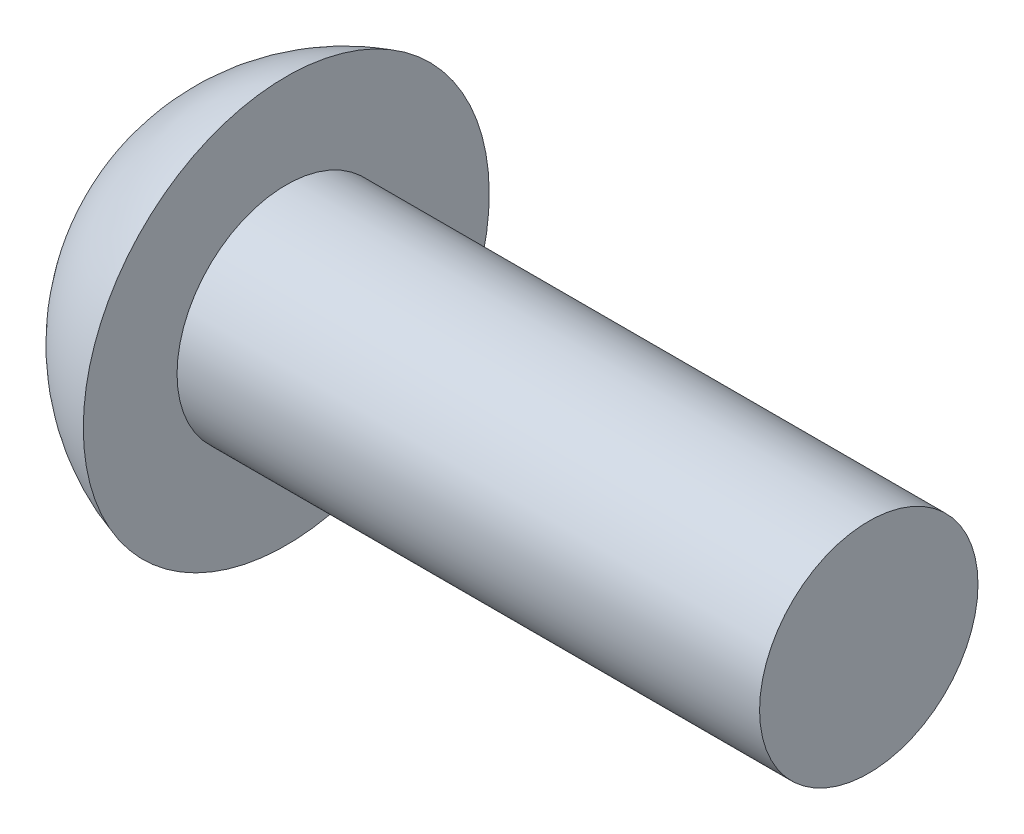
ISO-10303-21;
HEADER;
FILE_DESCRIPTION(('STEP AP214'),'2;1');
FILE_NAME('part.step','',(''),(''),'','','');
FILE_SCHEMA(('AUTOMOTIVE_DESIGN { 1 0 10303 214 1 1 1 1 }'));
ENDSEC;
DATA;
#1=APPLICATION_CONTEXT('core data for automotive mechanical design processes');
#2=APPLICATION_PROTOCOL_DEFINITION('international standard','automotive_design',2000,#1);
#3=PRODUCT_CONTEXT('',#1,'mechanical');
#4=PRODUCT('Part','Part','',(#3));
#5=PRODUCT_RELATED_PRODUCT_CATEGORY('part','',(#4));
#6=PRODUCT_DEFINITION_FORMATION('','',#4);
#7=PRODUCT_DEFINITION_CONTEXT('part definition',#1,'design');
#8=PRODUCT_DEFINITION('design','',#6,#7);
#9=PRODUCT_DEFINITION_SHAPE('','',#8);
#10=(LENGTH_UNIT() NAMED_UNIT(*) SI_UNIT(.MILLI.,.METRE.));
#11=(NAMED_UNIT(*) PLANE_ANGLE_UNIT() SI_UNIT($,.RADIAN.));
#12=(NAMED_UNIT(*) SI_UNIT($,.STERADIAN.) SOLID_ANGLE_UNIT());
#13=UNCERTAINTY_MEASURE_WITH_UNIT(LENGTH_MEASURE(1.E-05),#10,'distance_accuracy_value','');
#14=(GEOMETRIC_REPRESENTATION_CONTEXT(3) GLOBAL_UNCERTAINTY_ASSIGNED_CONTEXT((#13)) GLOBAL_UNIT_ASSIGNED_CONTEXT((#10,
#11,#12)) REPRESENTATION_CONTEXT('',''));
#15=CARTESIAN_POINT('',(0.,0.,0.));
#16=DIRECTION('',(0.,0.,1.));
#17=DIRECTION('',(1.,0.,0.));
#18=AXIS2_PLACEMENT_3D('',#15,#16,#17);
#19=CARTESIAN_POINT('',(2.9,0.,0.));
#20=DIRECTION('',(-1.,0.,0.));
#21=DIRECTION('',(0.,1.,0.));
#22=AXIS2_PLACEMENT_3D('',#19,#20,#21);
#23=SPHERICAL_SURFACE('',#22,2.9);
#24=CARTESIAN_POINT('',(2.1,0.,0.));
#25=DIRECTION('',(-1.,0.,0.));
#26=DIRECTION('',(0.,0.,1.));
#27=AXIS2_PLACEMENT_3D('',#24,#25,#26);
#28=CIRCLE('',#27,2.78747197295327);
#29=CARTESIAN_POINT('',(2.1,0.,2.78747197295327));
#30=VERTEX_POINT('',#29);
#31=EDGE_CURVE('E195',#30,#30,#28,.T.);
#32=ORIENTED_EDGE('',*,*,#31,.T.);
#33=EDGE_LOOP('',(#32));
#34=FACE_BOUND('',#33,.T.);
#35=CARTESIAN_POINT('',(0.078315280848916,0.,0.));
#36=DIRECTION('',(1.,0.,0.));
#37=DIRECTION('',(0.,0.,-1.));
#38=AXIS2_PLACEMENT_3D('',#35,#36,#37);
#39=CIRCLE('',#38,0.669399242387731);
#40=CARTESIAN_POINT('',(0.0783152808489151,-0.264999999999997,-0.61471159555459));
#41=VERTEX_POINT('',#40);
#42=CARTESIAN_POINT('',(0.078315280848916,-0.614711595554591,-0.265));
#43=VERTEX_POINT('',#42);
#44=EDGE_CURVE('E317',#41,#43,#39,.F.);
#45=ORIENTED_EDGE('',*,*,#44,.F.);
#46=CARTESIAN_POINT('',(2.9,-0.265,0.));
#47=DIRECTION('',(0.,1.,0.));
#48=DIRECTION('',(0.,0.,1.));
#49=AXIS2_PLACEMENT_3D('',#46,#47,#48);
#50=CIRCLE('',#49,2.88786685981193);
#51=CARTESIAN_POINT('',(0.337520560404616,-0.264999999999995,-1.33171848438434));
#52=VERTEX_POINT('',#51);
#53=EDGE_CURVE('E244',#52,#41,#50,.T.);
#54=ORIENTED_EDGE('',*,*,#53,.F.);
#55=CARTESIAN_POINT('',(2.92160851048534,0.,-0.0433399743390653));
#56=DIRECTION('',(0.446197753347436,0.,-0.894934391398443));
#57=DIRECTION('',(-0.894934391398443,0.,-0.446197753347436));
#58=AXIS2_PLACEMENT_3D('',#55,#56,#57);
#59=CIRCLE('',#58,2.89959561299484);
#60=CARTESIAN_POINT('',(0.337520560404616,0.265000000000005,-1.33171848438434));
#61=VERTEX_POINT('',#60);
#62=EDGE_CURVE('E218',#52,#61,#59,.T.);
#63=ORIENTED_EDGE('',*,*,#62,.T.);
#64=CARTESIAN_POINT('',(2.9,0.265,0.));
#65=DIRECTION('',(0.,-1.,0.));
#66=DIRECTION('',(0.,0.,-1.));
#67=AXIS2_PLACEMENT_3D('',#64,#65,#66);
#68=CIRCLE('',#67,2.88786685981193);
#69=CARTESIAN_POINT('',(0.0783152808489159,0.265000000000002,-0.614711595554588));
#70=VERTEX_POINT('',#69);
#71=EDGE_CURVE('E273',#70,#61,#68,.T.);
#72=ORIENTED_EDGE('',*,*,#71,.F.);
#73=CARTESIAN_POINT('',(0.078315280848916,0.614711595554587,-0.265));
#74=VERTEX_POINT('',#73);
#75=EDGE_CURVE('E333',#74,#70,#39,.F.);
#76=ORIENTED_EDGE('',*,*,#75,.F.);
#77=CARTESIAN_POINT('',(2.9,0.,-0.265));
#78=DIRECTION('',(0.,0.,1.));
#79=DIRECTION('',(0.,-1.,0.));
#80=AXIS2_PLACEMENT_3D('',#77,#78,#79);
#81=CIRCLE('',#80,2.88786685981193);
#82=CARTESIAN_POINT('',(0.337520560404617,1.33171848438434,-0.265));
#83=VERTEX_POINT('',#82);
#84=EDGE_CURVE('E212',#83,#74,#81,.T.);
#85=ORIENTED_EDGE('',*,*,#84,.F.);
#86=CARTESIAN_POINT('',(2.92160851048534,0.0433399743390649,0.));
#87=DIRECTION('',(0.446197753347436,0.894934391398443,0.));
#88=DIRECTION('',(-0.894934391398443,0.446197753347436,0.));
#89=AXIS2_PLACEMENT_3D('',#86,#87,#88);
#90=CIRCLE('',#89,2.89959561299484);
#91=CARTESIAN_POINT('',(0.337520560404617,1.33171848438434,0.265));
#92=VERTEX_POINT('',#91);
#93=EDGE_CURVE('E215',#83,#92,#90,.T.);
#94=ORIENTED_EDGE('',*,*,#93,.T.);
#95=CARTESIAN_POINT('',(2.9,0.,0.265));
#96=DIRECTION('',(0.,0.,-1.));
#97=DIRECTION('',(-1.,0.,0.));
#98=AXIS2_PLACEMENT_3D('',#95,#96,#97);
#99=CIRCLE('',#98,2.88786685981193);
#100=CARTESIAN_POINT('',(0.078315280848916,0.614711595554587,0.265));
#101=VERTEX_POINT('',#100);
#102=EDGE_CURVE('E203',#101,#92,#99,.T.);
#103=ORIENTED_EDGE('',*,*,#102,.F.);
#104=CARTESIAN_POINT('',(0.0783152808489156,0.264999999999998,0.614711595554589));
#105=VERTEX_POINT('',#104);
#106=EDGE_CURVE('E332',#105,#101,#39,.F.);
#107=ORIENTED_EDGE('',*,*,#106,.F.);
#108=CARTESIAN_POINT('',(0.337520560404616,0.264999999999995,1.33171848438434));
#109=VERTEX_POINT('',#108);
#110=EDGE_CURVE('E228',#109,#105,#68,.T.);
#111=ORIENTED_EDGE('',*,*,#110,.F.);
#112=CARTESIAN_POINT('',(2.92160851048534,0.,0.0433399743390653));
#113=DIRECTION('',(0.446197753347436,0.,0.894934391398443));
#114=DIRECTION('',(0.894934391398443,0.,-0.446197753347436));
#115=AXIS2_PLACEMENT_3D('',#112,#113,#114);
#116=CIRCLE('',#115,2.89959561299484);
#117=CARTESIAN_POINT('',(0.337520560404616,-0.265000000000004,1.33171848438434));
#118=VERTEX_POINT('',#117);
#119=EDGE_CURVE('E47',#109,#118,#116,.T.);
#120=ORIENTED_EDGE('',*,*,#119,.T.);
#121=CARTESIAN_POINT('',(0.0783152808489155,-0.265000000000002,0.614711595554588));
#122=VERTEX_POINT('',#121);
#123=EDGE_CURVE('E225',#122,#118,#50,.T.);
#124=ORIENTED_EDGE('',*,*,#123,.F.);
#125=CARTESIAN_POINT('',(0.078315280848916,-0.614711595554591,0.265));
#126=VERTEX_POINT('',#125);
#127=EDGE_CURVE('E363',#126,#122,#39,.F.);
#128=ORIENTED_EDGE('',*,*,#127,.F.);
#129=CARTESIAN_POINT('',(0.337520560404615,-1.33171848438434,0.264999999999999));
#130=VERTEX_POINT('',#129);
#131=EDGE_CURVE('E209',#130,#126,#99,.T.);
#132=ORIENTED_EDGE('',*,*,#131,.F.);
#133=CARTESIAN_POINT('',(2.92160851048534,-0.0433399743390657,0.));
#134=DIRECTION('',(0.446197753347436,-0.894934391398443,0.));
#135=DIRECTION('',(0.894934391398443,0.446197753347436,0.));
#136=AXIS2_PLACEMENT_3D('',#133,#134,#135);
#137=CIRCLE('',#136,2.89959561299484);
#138=CARTESIAN_POINT('',(0.337520560404615,-1.33171848438434,-0.265));
#139=VERTEX_POINT('',#138);
#140=EDGE_CURVE('E200',#130,#139,#137,.T.);
#141=ORIENTED_EDGE('',*,*,#140,.T.);
#142=EDGE_CURVE('E62',#43,#139,#81,.T.);
#143=ORIENTED_EDGE('',*,*,#142,.F.);
#144=EDGE_LOOP('',(#45,#54,#63,#72,#76,#85,#94,#103,#107,#111,#120,#124,#128,#132,#141,#143));
#145=FACE_BOUND('',#144,.T.);
#146=ADVANCED_FACE('F34',(#34,#145),#23,.T.);
#147=CARTESIAN_POINT('',(1.7,0.652411408052676,-0.265));
#148=DIRECTION('',(0.,0.,1.));
#149=DIRECTION('',(0.,-1.,0.));
#150=AXIS2_PLACEMENT_3D('',#147,#148,#149);
#151=PLANE('',#150);
#152=ORIENTED_EDGE('',*,*,#84,.T.);
#153=CARTESIAN_POINT('',(-0.981933015225682,0.694712374001879,-0.265));
#154=CARTESIAN_POINT('',(-0.777540178554923,0.67941354952456,-0.265));
#155=CARTESIAN_POINT('',(-0.573151839935429,0.664054243787275,-0.265));
#156=CARTESIAN_POINT('',(-0.164385971025144,0.633177915366396,-0.265));
#157=CARTESIAN_POINT('',(0.039991559201344,0.617660891831827,-0.265));
#158=CARTESIAN_POINT('',(0.448731756270768,0.586432540525166,-0.265));
#159=CARTESIAN_POINT('',(0.653094423116314,0.570721212787268,-0.265));
#160=CARTESIAN_POINT('',(1.06179964417998,0.539049879940202,-0.265));
#161=CARTESIAN_POINT('',(1.26614219847917,0.52308987587849,-0.265));
#162=CARTESIAN_POINT('',(1.74108068166978,0.485616257392884,-0.265));
#163=CARTESIAN_POINT('',(2.01166699100833,0.463980474763996,-0.265));
#164=CARTESIAN_POINT('',(2.55276895388886,0.419865793528032,-0.265));
#165=CARTESIAN_POINT('',(2.82328460806535,0.397386902774242,-0.265));
#166=CARTESIAN_POINT('',(3.22897582593126,0.362622847384073,-0.265));
#167=CARTESIAN_POINT('',(3.36419602364132,0.350860224074462,-0.265));
#168=CARTESIAN_POINT('',(3.63459299738675,0.326855757063686,-0.265));
#169=CARTESIAN_POINT('',(3.76976977370504,0.314613916551499,-0.265));
#170=CARTESIAN_POINT('',(4.04006905664263,0.289478504725017,-0.265));
#171=CARTESIAN_POINT('',(4.17519156089061,0.276584907518763,-0.265));
#172=CARTESIAN_POINT('',(4.44533503936018,0.249748787596908,-0.265));
#173=CARTESIAN_POINT('',(4.58035601113307,0.235806240354233,-0.265));
#174=CARTESIAN_POINT('',(4.71530211337658,0.221140684442859,-0.265));
#175=B_SPLINE_CURVE_WITH_KNOTS('',3,(#153,#154,#155,#156,#157,#158,#159,#160,#161,#162,#163,
#164,#165,#166,#167,#168,#169,#170,#171,#172,#173,#174),.UNSPECIFIED.,.F.,.F.,(4,2,2,2,2,2,2,2,
2,2,4),(0.,0.614893822921503,1.22979096530522,1.84468799948177,2.45958244433443,
3.27393151276002,4.08827299766283,4.49546484032848,4.90265397377325,5.30985929611757,
5.7170741429014),.UNSPECIFIED.);
#176=CARTESIAN_POINT('',(1.7,0.488785228909386,-0.265));
#177=VERTEX_POINT('',#176);
#178=EDGE_CURVE('E352',#74,#177,#175,.T.);
#179=ORIENTED_EDGE('',*,*,#178,.T.);
#180=DIRECTION('',(0.,1.,0.));
#181=VECTOR('',#180,1.);
#182=CARTESIAN_POINT('',(1.7,-0.652411408052676,-0.265));
#183=LINE('',#182,#181);
#184=CARTESIAN_POINT('',(1.7,0.652411408052676,-0.265));
#185=VERTEX_POINT('',#184);
#186=EDGE_CURVE('E296',#177,#185,#183,.T.);
#187=ORIENTED_EDGE('',*,*,#186,.T.);
#188=DIRECTION('',(0.894934391398443,-0.446197753347436,0.));
#189=VECTOR('',#188,1.);
#190=CARTESIAN_POINT('',(0.,1.5,-0.265));
#191=LINE('',#190,#189);
#192=EDGE_CURVE('E274',#83,#185,#191,.T.);
#193=ORIENTED_EDGE('',*,*,#192,.F.);
#194=EDGE_LOOP('',(#152,#179,#187,#193));
#195=FACE_BOUND('',#194,.T.);
#196=ADVANCED_FACE('F168',(#195),#151,.T.);
#197=CARTESIAN_POINT('',(1.7,-0.652411408052676,-0.265));
#198=VERTEX_POINT('',#197);
#199=CARTESIAN_POINT('',(1.7,-0.488785228909386,-0.265));
#200=VERTEX_POINT('',#199);
#201=EDGE_CURVE('E294',#198,#200,#183,.T.);
#202=ORIENTED_EDGE('',*,*,#201,.T.);
#203=CARTESIAN_POINT('',(-0.981933015225682,-0.694712374001879,-0.265));
#204=CARTESIAN_POINT('',(-0.777540178554923,-0.67941354952456,-0.265));
#205=CARTESIAN_POINT('',(-0.57315183993543,-0.664054243787275,-0.265));
#206=CARTESIAN_POINT('',(-0.164385971025144,-0.633177915366396,-0.265));
#207=CARTESIAN_POINT('',(0.0399915592013435,-0.617660891831827,-0.265));
#208=CARTESIAN_POINT('',(0.448731756270768,-0.586432540525166,-0.265));
#209=CARTESIAN_POINT('',(0.653094423116314,-0.570721212787268,-0.265));
#210=CARTESIAN_POINT('',(1.06179964417998,-0.539049879940202,-0.265));
#211=CARTESIAN_POINT('',(1.26614219847917,-0.52308987587849,-0.265));
#212=CARTESIAN_POINT('',(1.74108068166978,-0.485616257392883,-0.265));
#213=CARTESIAN_POINT('',(2.01166699100833,-0.463980474763996,-0.265));
#214=CARTESIAN_POINT('',(2.55276895388886,-0.419865793528032,-0.265));
#215=CARTESIAN_POINT('',(2.82328460806535,-0.397386902774242,-0.265));
#216=CARTESIAN_POINT('',(3.22897582593126,-0.362622847384073,-0.265));
#217=CARTESIAN_POINT('',(3.36419602364132,-0.350860224074462,-0.265));
#218=CARTESIAN_POINT('',(3.63459299738675,-0.326855757063686,-0.265));
#219=CARTESIAN_POINT('',(3.76976977370504,-0.314613916551499,-0.265));
#220=CARTESIAN_POINT('',(4.04006905664263,-0.289478504725017,-0.265));
#221=CARTESIAN_POINT('',(4.17519156089061,-0.276584907518762,-0.265));
#222=CARTESIAN_POINT('',(4.44533503936018,-0.249748787596907,-0.265));
#223=CARTESIAN_POINT('',(4.58035601113307,-0.235806240354233,-0.265));
#224=CARTESIAN_POINT('',(4.71530211337659,-0.221140684442858,-0.265));
#225=B_SPLINE_CURVE_WITH_KNOTS('',3,(#203,#204,#205,#206,#207,#208,#209,#210,#211,#212,#213,
#214,#215,#216,#217,#218,#219,#220,#221,#222,#223,#224),.UNSPECIFIED.,.F.,.F.,(4,2,2,2,2,2,2,2,
2,2,4),(0.,0.614893822921502,1.22979096530522,1.84468799948177,2.45958244433443,
3.27393151276002,4.08827299766283,4.49546484032848,4.90265397377325,5.30985929611757,
5.7170741429014),.UNSPECIFIED.);
#226=EDGE_CURVE('E331',#200,#43,#225,.F.);
#227=ORIENTED_EDGE('',*,*,#226,.T.);
#228=ORIENTED_EDGE('',*,*,#142,.T.);
#229=DIRECTION('',(0.894934391398443,0.446197753347436,0.));
#230=VECTOR('',#229,1.);
#231=CARTESIAN_POINT('',(0.,-1.5,-0.265));
#232=LINE('',#231,#230);
#233=EDGE_CURVE('E279',#139,#198,#232,.T.);
#234=ORIENTED_EDGE('',*,*,#233,.T.);
#235=EDGE_LOOP('',(#202,#227,#228,#234));
#236=FACE_BOUND('',#235,.T.);
#237=ADVANCED_FACE('F174',(#236),#151,.T.);
#238=CARTESIAN_POINT('',(1.7,-0.652411408052676,0.265));
#239=DIRECTION('',(0.,0.,-1.));
#240=DIRECTION('',(-1.,0.,0.));
#241=AXIS2_PLACEMENT_3D('',#238,#239,#240);
#242=PLANE('',#241);
#243=DIRECTION('',(0.,-1.,0.));
#244=VECTOR('',#243,1.);
#245=CARTESIAN_POINT('',(1.7,0.652411408052676,0.265));
#246=LINE('',#245,#244);
#247=CARTESIAN_POINT('',(1.7,0.652411408052676,0.265));
#248=VERTEX_POINT('',#247);
#249=CARTESIAN_POINT('',(1.7,0.488785228909386,0.264999999999999));
#250=VERTEX_POINT('',#249);
#251=EDGE_CURVE('E287',#248,#250,#246,.T.);
#252=ORIENTED_EDGE('',*,*,#251,.T.);
#253=CARTESIAN_POINT('',(-0.981933015224673,0.694712374001804,0.265));
#254=CARTESIAN_POINT('',(-0.777540178553934,0.679413549524486,0.265));
#255=CARTESIAN_POINT('',(-0.57315183993446,0.664054243787202,0.265));
#256=CARTESIAN_POINT('',(-0.164385971024213,0.633177915366326,0.265));
#257=CARTESIAN_POINT('',(0.0399915592022549,0.617660891831758,0.265));
#258=CARTESIAN_POINT('',(0.44873175627164,0.586432540525099,0.265));
#259=CARTESIAN_POINT('',(0.653094423117166,0.570721212787203,0.265));
#260=CARTESIAN_POINT('',(1.06179964418079,0.539049879940139,0.265));
#261=CARTESIAN_POINT('',(1.26614219847997,0.523089875878427,0.265));
#262=CARTESIAN_POINT('',(1.74108068167055,0.485616257392822,0.265));
#263=CARTESIAN_POINT('',(2.01166699100911,0.463980474763934,0.265));
#264=CARTESIAN_POINT('',(2.55276895388964,0.419865793527968,0.265));
#265=CARTESIAN_POINT('',(2.82328460806612,0.397386902774177,0.265));
#266=CARTESIAN_POINT('',(3.22897582593204,0.362622847384006,0.265));
#267=CARTESIAN_POINT('',(3.36419602364209,0.350860224074395,0.265));
#268=CARTESIAN_POINT('',(3.63459299738752,0.326855757063616,0.265));
#269=CARTESIAN_POINT('',(3.76976977370581,0.314613916551428,0.265));
#270=CARTESIAN_POINT('',(4.0400690566434,0.289478504724944,0.265));
#271=CARTESIAN_POINT('',(4.17519156089139,0.276584907518687,0.265));
#272=CARTESIAN_POINT('',(4.44533503936095,0.249748787596828,0.265));
#273=CARTESIAN_POINT('',(4.58035601113385,0.235806240354151,0.265));
#274=CARTESIAN_POINT('',(4.71530211337736,0.221140684442774,0.265));
#275=B_SPLINE_CURVE_WITH_KNOTS('',3,(#253,#254,#255,#256,#257,#258,#259,#260,#261,#262,#263,
#264,#265,#266,#267,#268,#269,#270,#271,#272,#273,#274),.UNSPECIFIED.,.F.,.F.,(4,2,2,2,2,2,2,2,
2,2,4),(0.,0.614893822921444,1.2297909653051,1.8446879994816,2.4595824443342,3.27393151275979,
4.0882729976626,4.49546484032825,4.90265397377302,5.30985929611733,5.71707414290117),.UNSPECIFIED.);
#276=EDGE_CURVE('E249',#250,#101,#275,.F.);
#277=ORIENTED_EDGE('',*,*,#276,.T.);
#278=ORIENTED_EDGE('',*,*,#102,.T.);
#279=DIRECTION('',(0.894934391398443,-0.446197753347436,0.));
#280=VECTOR('',#279,1.);
#281=CARTESIAN_POINT('',(0.,1.5,0.265));
#282=LINE('',#281,#280);
#283=EDGE_CURVE('E277',#92,#248,#282,.T.);
#284=ORIENTED_EDGE('',*,*,#283,.T.);
#285=EDGE_LOOP('',(#252,#277,#278,#284));
#286=FACE_BOUND('',#285,.T.);
#287=ADVANCED_FACE('F348',(#286),#242,.T.);
#288=ORIENTED_EDGE('',*,*,#131,.T.);
#289=CARTESIAN_POINT('',(-0.981933015225681,-0.694712374001879,0.264999999999999));
#290=CARTESIAN_POINT('',(-0.777540178554922,-0.67941354952456,0.264999999999999));
#291=CARTESIAN_POINT('',(-0.573151839935429,-0.664054243787275,0.264999999999999));
#292=CARTESIAN_POINT('',(-0.164385971025144,-0.633177915366396,0.265));
#293=CARTESIAN_POINT('',(0.039991559201344,-0.617660891831827,0.265));
#294=CARTESIAN_POINT('',(0.448731756270768,-0.586432540525166,0.265));
#295=CARTESIAN_POINT('',(0.653094423116314,-0.570721212787269,0.265));
#296=CARTESIAN_POINT('',(1.06179964417998,-0.539049879940202,0.265));
#297=CARTESIAN_POINT('',(1.26614219847917,-0.52308987587849,0.265));
#298=CARTESIAN_POINT('',(1.74108068166978,-0.485616257392884,0.265));
#299=CARTESIAN_POINT('',(2.01166699100833,-0.463980474763996,0.265));
#300=CARTESIAN_POINT('',(2.55276895388886,-0.419865793528032,0.265));
#301=CARTESIAN_POINT('',(2.82328460806535,-0.397386902774242,0.265));
#302=CARTESIAN_POINT('',(3.22897582593126,-0.362622847384073,0.265));
#303=CARTESIAN_POINT('',(3.36419602364132,-0.350860224074462,0.265));
#304=CARTESIAN_POINT('',(3.63459299738675,-0.326855757063686,0.265));
#305=CARTESIAN_POINT('',(3.76976977370504,-0.314613916551499,0.265));
#306=CARTESIAN_POINT('',(4.04006905664263,-0.289478504725017,0.265));
#307=CARTESIAN_POINT('',(4.17519156089061,-0.276584907518762,0.265));
#308=CARTESIAN_POINT('',(4.44533503936018,-0.249748787596907,0.265));
#309=CARTESIAN_POINT('',(4.58035601113307,-0.235806240354233,0.265));
#310=CARTESIAN_POINT('',(4.71530211337659,-0.221140684442858,0.265));
#311=B_SPLINE_CURVE_WITH_KNOTS('',3,(#289,#290,#291,#292,#293,#294,#295,#296,#297,#298,#299,
#300,#301,#302,#303,#304,#305,#306,#307,#308,#309,#310),.UNSPECIFIED.,.F.,.F.,(4,2,2,2,2,2,2,2,
2,2,4),(0.,0.614893822921502,1.22979096530522,1.84468799948177,2.45958244433443,
3.27393151276002,4.08827299766283,4.49546484032848,4.90265397377325,5.30985929611757,
5.7170741429014),.UNSPECIFIED.);
#312=CARTESIAN_POINT('',(1.7,-0.488785228909386,0.264999999999999));
#313=VERTEX_POINT('',#312);
#314=EDGE_CURVE('E364',#126,#313,#311,.T.);
#315=ORIENTED_EDGE('',*,*,#314,.T.);
#316=CARTESIAN_POINT('',(1.7,-0.652411408052676,0.265));
#317=VERTEX_POINT('',#316);
#318=EDGE_CURVE('E290',#313,#317,#246,.T.);
#319=ORIENTED_EDGE('',*,*,#318,.T.);
#320=DIRECTION('',(0.894934391398443,0.446197753347436,0.));
#321=VECTOR('',#320,1.);
#322=CARTESIAN_POINT('',(0.,-1.5,0.264999999999999));
#323=LINE('',#322,#321);
#324=EDGE_CURVE('E281',#130,#317,#323,.T.);
#325=ORIENTED_EDGE('',*,*,#324,.F.);
#326=EDGE_LOOP('',(#288,#315,#319,#325));
#327=FACE_BOUND('',#326,.T.);
#328=ADVANCED_FACE('F394',(#327),#242,.T.);
#329=CARTESIAN_POINT('',(1.7,0.652411408052676,-0.265));
#330=DIRECTION('',(-1.,0.,0.));
#331=DIRECTION('',(0.,0.,1.));
#332=AXIS2_PLACEMENT_3D('',#329,#330,#331);
#333=PLANE('',#332);
#334=ORIENTED_EDGE('',*,*,#318,.F.);
#335=CARTESIAN_POINT('',(1.7,0.,0.));
#336=DIRECTION('',(-1.,0.,0.));
#337=DIRECTION('',(0.,0.,1.));
#338=AXIS2_PLACEMENT_3D('',#335,#336,#337);
#339=CIRCLE('',#338,0.556);
#340=EDGE_CURVE('E326',#200,#313,#339,.T.);
#341=ORIENTED_EDGE('',*,*,#340,.F.);
#342=ORIENTED_EDGE('',*,*,#201,.F.);
#343=DIRECTION('',(0.,0.,1.));
#344=VECTOR('',#343,1.);
#345=CARTESIAN_POINT('',(1.7,-0.652411408052676,-0.265));
#346=LINE('',#345,#344);
#347=EDGE_CURVE('E284',#198,#317,#346,.T.);
#348=ORIENTED_EDGE('',*,*,#347,.T.);
#349=EDGE_LOOP('',(#334,#341,#342,#348));
#350=FACE_BOUND('',#349,.T.);
#351=ADVANCED_FACE('F387',(#350),#333,.T.);
#352=DIRECTION('',(0.,0.,-1.));
#353=VECTOR('',#352,1.);
#354=CARTESIAN_POINT('',(1.7,-0.265000000000002,0.652411408052675));
#355=LINE('',#354,#353);
#356=CARTESIAN_POINT('',(1.7,-0.264999999999998,-0.488785228909387));
#357=VERTEX_POINT('',#356);
#358=CARTESIAN_POINT('',(1.7,-0.264999999999997,-0.652411408052677));
#359=VERTEX_POINT('',#358);
#360=EDGE_CURVE('E266',#357,#359,#355,.T.);
#361=ORIENTED_EDGE('',*,*,#360,.F.);
#362=CARTESIAN_POINT('',(1.7,0.265000000000002,-0.488785228909384));
#363=VERTEX_POINT('',#362);
#364=EDGE_CURVE('E54',#363,#357,#339,.T.);
#365=ORIENTED_EDGE('',*,*,#364,.F.);
#366=DIRECTION('',(0.,0.,1.));
#367=VECTOR('',#366,1.);
#368=CARTESIAN_POINT('',(1.7,0.265000000000002,-0.652411408052675));
#369=LINE('',#368,#367);
#370=CARTESIAN_POINT('',(1.7,0.265000000000002,-0.652411408052675));
#371=VERTEX_POINT('',#370);
#372=EDGE_CURVE('E269',#371,#363,#369,.T.);
#373=ORIENTED_EDGE('',*,*,#372,.F.);
#374=DIRECTION('',(0.,-1.,0.));
#375=VECTOR('',#374,1.);
#376=CARTESIAN_POINT('',(1.7,0.265000000000002,-0.652411408052675));
#377=LINE('',#376,#375);
#378=EDGE_CURVE('E260',#371,#359,#377,.T.);
#379=ORIENTED_EDGE('',*,*,#378,.T.);
#380=EDGE_LOOP('',(#361,#365,#373,#379));
#381=FACE_BOUND('',#380,.T.);
#382=ADVANCED_FACE('F321',(#381),#333,.T.);
#383=ORIENTED_EDGE('',*,*,#186,.F.);
#384=EDGE_CURVE('E325',#250,#177,#339,.T.);
#385=ORIENTED_EDGE('',*,*,#384,.F.);
#386=ORIENTED_EDGE('',*,*,#251,.F.);
#387=DIRECTION('',(0.,0.,-1.));
#388=VECTOR('',#387,1.);
#389=CARTESIAN_POINT('',(1.7,0.652411408052676,0.265));
#390=LINE('',#389,#388);
#391=EDGE_CURVE('E291',#248,#185,#390,.T.);
#392=ORIENTED_EDGE('',*,*,#391,.T.);
#393=EDGE_LOOP('',(#383,#385,#386,#392));
#394=FACE_BOUND('',#393,.T.);
#395=ADVANCED_FACE('F388',(#394),#333,.T.);
#396=CARTESIAN_POINT('',(1.7,0.264999999999998,0.652411408052677));
#397=DIRECTION('',(0.,-1.,0.));
#398=DIRECTION('',(0.,0.,-1.));
#399=AXIS2_PLACEMENT_3D('',#396,#397,#398);
#400=PLANE('',#399);
#401=ORIENTED_EDGE('',*,*,#110,.T.);
#402=CARTESIAN_POINT('',(-0.981933015225681,0.264999999999998,0.69471237400188));
#403=CARTESIAN_POINT('',(-0.777540178554922,0.264999999999998,0.679413549524561));
#404=CARTESIAN_POINT('',(-0.573151839935429,0.264999999999998,0.664054243787276));
#405=CARTESIAN_POINT('',(-0.164385971025144,0.264999999999998,0.633177915366397));
#406=CARTESIAN_POINT('',(0.039991559201344,0.264999999999998,0.617660891831827));
#407=CARTESIAN_POINT('',(0.448731756270768,0.264999999999998,0.586432540525167));
#408=CARTESIAN_POINT('',(0.653094423116314,0.264999999999998,0.570721212787269));
#409=CARTESIAN_POINT('',(1.06179964417998,0.264999999999998,0.539049879940203));
#410=CARTESIAN_POINT('',(1.26614219847917,0.264999999999998,0.523089875878491));
#411=CARTESIAN_POINT('',(1.74108068166978,0.264999999999998,0.485616257392884));
#412=CARTESIAN_POINT('',(2.01166699100833,0.264999999999998,0.463980474763997));
#413=CARTESIAN_POINT('',(2.55276895388886,0.264999999999998,0.419865793528033));
#414=CARTESIAN_POINT('',(2.82328460806535,0.264999999999999,0.397386902774243));
#415=CARTESIAN_POINT('',(3.22897582593126,0.264999999999999,0.362622847384074));
#416=CARTESIAN_POINT('',(3.36419602364132,0.264999999999999,0.350860224074463));
#417=CARTESIAN_POINT('',(3.63459299738675,0.264999999999999,0.326855757063687));
#418=CARTESIAN_POINT('',(3.76976977370504,0.264999999999999,0.3146139165515));
#419=CARTESIAN_POINT('',(4.04006905664263,0.264999999999999,0.289478504725018));
#420=CARTESIAN_POINT('',(4.17519156089061,0.264999999999999,0.276584907518763));
#421=CARTESIAN_POINT('',(4.44533503936018,0.264999999999999,0.249748787596908));
#422=CARTESIAN_POINT('',(4.58035601113307,0.264999999999999,0.235806240354234));
#423=CARTESIAN_POINT('',(4.71530211337659,0.264999999999999,0.221140684442859));
#424=B_SPLINE_CURVE_WITH_KNOTS('',3,(#402,#403,#404,#405,#406,#407,#408,#409,#410,#411,#412,
#413,#414,#415,#416,#417,#418,#419,#420,#421,#422,#423),.UNSPECIFIED.,.F.,.F.,(4,2,2,2,2,2,2,2,
2,2,4),(0.,0.614893822921502,1.22979096530522,1.84468799948177,2.45958244433443,
3.27393151276002,4.08827299766283,4.49546484032848,4.90265397377325,5.30985929611757,
5.7170741429014),.UNSPECIFIED.);
#425=CARTESIAN_POINT('',(1.7,0.264999999999998,0.488785228909386));
#426=VERTEX_POINT('',#425);
#427=EDGE_CURVE('E413',#105,#426,#424,.T.);
#428=ORIENTED_EDGE('',*,*,#427,.T.);
#429=CARTESIAN_POINT('',(1.7,0.264999999999998,0.652411408052677));
#430=VERTEX_POINT('',#429);
#431=EDGE_CURVE('E242',#426,#430,#369,.T.);
#432=ORIENTED_EDGE('',*,*,#431,.T.);
#433=DIRECTION('',(0.894934391398443,0.,-0.446197753347436));
#434=VECTOR('',#433,1.);
#435=CARTESIAN_POINT('',(0.,0.264999999999995,1.5));
#436=LINE('',#435,#434);
#437=EDGE_CURVE('E235',#109,#430,#436,.T.);
#438=ORIENTED_EDGE('',*,*,#437,.F.);
#439=EDGE_LOOP('',(#401,#428,#432,#438));
#440=FACE_BOUND('',#439,.T.);
#441=ADVANCED_FACE('F239',(#440),#400,.T.);
#442=CARTESIAN_POINT('',(1.7,-0.264999999999997,-0.652411408052677));
#443=DIRECTION('',(0.,1.,0.));
#444=DIRECTION('',(-1.,0.,0.));
#445=AXIS2_PLACEMENT_3D('',#442,#443,#444);
#446=PLANE('',#445);
#447=CARTESIAN_POINT('',(1.7,-0.265000000000002,0.652411408052675));
#448=VERTEX_POINT('',#447);
#449=CARTESIAN_POINT('',(1.7,-0.265000000000002,0.488785228909384));
#450=VERTEX_POINT('',#449);
#451=EDGE_CURVE('E263',#448,#450,#355,.T.);
#452=ORIENTED_EDGE('',*,*,#451,.T.);
#453=CARTESIAN_POINT('',(-0.981933015224674,-0.265000000000002,0.694712374001803));
#454=CARTESIAN_POINT('',(-0.777540178553935,-0.265000000000002,0.679413549524485));
#455=CARTESIAN_POINT('',(-0.573151839934461,-0.265000000000002,0.664054243787201));
#456=CARTESIAN_POINT('',(-0.164385971024214,-0.265000000000002,0.633177915366325));
#457=CARTESIAN_POINT('',(0.0399915592022547,-0.265000000000002,0.617660891831756));
#458=CARTESIAN_POINT('',(0.44873175627164,-0.265000000000002,0.586432540525098));
#459=CARTESIAN_POINT('',(0.653094423117166,-0.265000000000002,0.570721212787202));
#460=CARTESIAN_POINT('',(1.06179964418079,-0.265000000000002,0.539049879940138));
#461=CARTESIAN_POINT('',(1.26614219847997,-0.265000000000002,0.523089875878427));
#462=CARTESIAN_POINT('',(1.74108068167055,-0.265000000000002,0.485616257392821));
#463=CARTESIAN_POINT('',(2.01166699100911,-0.265000000000002,0.463980474763933));
#464=CARTESIAN_POINT('',(2.55276895388964,-0.265000000000001,0.419865793527967));
#465=CARTESIAN_POINT('',(2.82328460806612,-0.265000000000001,0.397386902774176));
#466=CARTESIAN_POINT('',(3.22897582593204,-0.265000000000001,0.362622847384005));
#467=CARTESIAN_POINT('',(3.36419602364209,-0.265000000000001,0.350860224074393));
#468=CARTESIAN_POINT('',(3.63459299738752,-0.265000000000001,0.326855757063615));
#469=CARTESIAN_POINT('',(3.76976977370582,-0.265000000000001,0.314613916551427));
#470=CARTESIAN_POINT('',(4.0400690566434,-0.265000000000001,0.289478504724943));
#471=CARTESIAN_POINT('',(4.17519156089139,-0.265000000000001,0.276584907518686));
#472=CARTESIAN_POINT('',(4.44533503936095,-0.265000000000001,0.249748787596827));
#473=CARTESIAN_POINT('',(4.58035601113385,-0.265000000000001,0.235806240354151));
#474=CARTESIAN_POINT('',(4.71530211337736,-0.265000000000001,0.221140684442773));
#475=B_SPLINE_CURVE_WITH_KNOTS('',3,(#453,#454,#455,#456,#457,#458,#459,#460,#461,#462,#463,
#464,#465,#466,#467,#468,#469,#470,#471,#472,#473,#474),.UNSPECIFIED.,.F.,.F.,(4,2,2,2,2,2,2,2,
2,2,4),(0.,0.614893822921444,1.2297909653051,1.8446879994816,2.4595824443342,3.27393151275979,
4.0882729976626,4.49546484032825,4.90265397377302,5.30985929611733,5.71707414290117),.UNSPECIFIED.);
#476=EDGE_CURVE('E357',#450,#122,#475,.F.);
#477=ORIENTED_EDGE('',*,*,#476,.T.);
#478=ORIENTED_EDGE('',*,*,#123,.T.);
#479=DIRECTION('',(0.894934391398443,0.,-0.446197753347436));
#480=VECTOR('',#479,1.);
#481=CARTESIAN_POINT('',(0.,-0.265000000000005,1.5));
#482=LINE('',#481,#480);
#483=EDGE_CURVE('E237',#118,#448,#482,.T.);
#484=ORIENTED_EDGE('',*,*,#483,.T.);
#485=EDGE_LOOP('',(#452,#477,#478,#484));
#486=FACE_BOUND('',#485,.T.);
#487=ADVANCED_FACE('F368',(#486),#446,.T.);
#488=ORIENTED_EDGE('',*,*,#372,.T.);
#489=CARTESIAN_POINT('',(-0.981933015224674,0.265000000000003,-0.694712374001803));
#490=CARTESIAN_POINT('',(-0.777540178553934,0.265000000000002,-0.679413549524485));
#491=CARTESIAN_POINT('',(-0.57315183993446,0.265000000000002,-0.664054243787201));
#492=CARTESIAN_POINT('',(-0.164385971024214,0.265000000000002,-0.633177915366325));
#493=CARTESIAN_POINT('',(0.0399915592022546,0.265000000000002,-0.617660891831756));
#494=CARTESIAN_POINT('',(0.44873175627164,0.265000000000002,-0.586432540525098));
#495=CARTESIAN_POINT('',(0.653094423117166,0.265000000000002,-0.570721212787202));
#496=CARTESIAN_POINT('',(1.06179964418079,0.265000000000002,-0.539049879940138));
#497=CARTESIAN_POINT('',(1.26614219847997,0.265000000000002,-0.523089875878426));
#498=CARTESIAN_POINT('',(1.74108068167055,0.265000000000002,-0.485616257392821));
#499=CARTESIAN_POINT('',(2.01166699100911,0.265000000000002,-0.463980474763933));
#500=CARTESIAN_POINT('',(2.55276895388964,0.265000000000001,-0.419865793527967));
#501=CARTESIAN_POINT('',(2.82328460806612,0.265000000000001,-0.397386902774176));
#502=CARTESIAN_POINT('',(3.22897582593204,0.265000000000001,-0.362622847384005));
#503=CARTESIAN_POINT('',(3.36419602364209,0.265000000000001,-0.350860224074394));
#504=CARTESIAN_POINT('',(3.63459299738752,0.265000000000001,-0.326855757063616));
#505=CARTESIAN_POINT('',(3.76976977370582,0.265000000000001,-0.314613916551427));
#506=CARTESIAN_POINT('',(4.0400690566434,0.265000000000001,-0.289478504724943));
#507=CARTESIAN_POINT('',(4.17519156089139,0.265000000000001,-0.276584907518687));
#508=CARTESIAN_POINT('',(4.44533503936095,0.265000000000001,-0.249748787596828));
#509=CARTESIAN_POINT('',(4.58035601113384,0.265000000000001,-0.235806240354151));
#510=CARTESIAN_POINT('',(4.71530211337736,0.265000000000001,-0.221140684442773));
#511=B_SPLINE_CURVE_WITH_KNOTS('',3,(#489,#490,#491,#492,#493,#494,#495,#496,#497,#498,#499,
#500,#501,#502,#503,#504,#505,#506,#507,#508,#509,#510),.UNSPECIFIED.,.F.,.F.,(4,2,2,2,2,2,2,2,
2,2,4),(0.,0.614893822921444,1.2297909653051,1.8446879994816,2.4595824443342,3.27393151275979,
4.0882729976626,4.49546484032825,4.90265397377302,5.30985929611733,5.71707414290117),.UNSPECIFIED.);
#512=EDGE_CURVE('E309',#363,#70,#511,.F.);
#513=ORIENTED_EDGE('',*,*,#512,.T.);
#514=ORIENTED_EDGE('',*,*,#71,.T.);
#515=DIRECTION('',(0.894934391398443,0.,0.446197753347436));
#516=VECTOR('',#515,1.);
#517=CARTESIAN_POINT('',(0.,0.265000000000005,-1.5));
#518=LINE('',#517,#516);
#519=EDGE_CURVE('E246',#61,#371,#518,.T.);
#520=ORIENTED_EDGE('',*,*,#519,.T.);
#521=EDGE_LOOP('',(#488,#513,#514,#520));
#522=FACE_BOUND('',#521,.T.);
#523=ADVANCED_FACE('F307',(#522),#400,.T.);
#524=ORIENTED_EDGE('',*,*,#53,.T.);
#525=CARTESIAN_POINT('',(-0.981933015225682,-0.264999999999997,-0.69471237400188));
#526=CARTESIAN_POINT('',(-0.777540178554923,-0.264999999999997,-0.679413549524561));
#527=CARTESIAN_POINT('',(-0.57315183993543,-0.264999999999997,-0.664054243787276));
#528=CARTESIAN_POINT('',(-0.164385971025144,-0.264999999999997,-0.633177915366398));
#529=CARTESIAN_POINT('',(0.0399915592013435,-0.264999999999997,-0.617660891831828));
#530=CARTESIAN_POINT('',(0.448731756270768,-0.264999999999998,-0.586432540525167));
#531=CARTESIAN_POINT('',(0.653094423116314,-0.264999999999998,-0.570721212787269));
#532=CARTESIAN_POINT('',(1.06179964417998,-0.264999999999998,-0.539049879940203));
#533=CARTESIAN_POINT('',(1.26614219847917,-0.264999999999998,-0.523089875878491));
#534=CARTESIAN_POINT('',(1.74108068166978,-0.264999999999998,-0.485616257392884));
#535=CARTESIAN_POINT('',(2.01166699100833,-0.264999999999998,-0.463980474763997));
#536=CARTESIAN_POINT('',(2.55276895388886,-0.264999999999998,-0.419865793528033));
#537=CARTESIAN_POINT('',(2.82328460806535,-0.264999999999999,-0.397386902774243));
#538=CARTESIAN_POINT('',(3.22897582593126,-0.264999999999999,-0.362622847384074));
#539=CARTESIAN_POINT('',(3.36419602364132,-0.264999999999999,-0.350860224074463));
#540=CARTESIAN_POINT('',(3.63459299738675,-0.264999999999999,-0.326855757063687));
#541=CARTESIAN_POINT('',(3.76976977370504,-0.264999999999999,-0.3146139165515));
#542=CARTESIAN_POINT('',(4.04006905664263,-0.264999999999999,-0.289478504725018));
#543=CARTESIAN_POINT('',(4.17519156089061,-0.264999999999999,-0.276584907518763));
#544=CARTESIAN_POINT('',(4.44533503936018,-0.264999999999999,-0.249748787596908));
#545=CARTESIAN_POINT('',(4.58035601113307,-0.264999999999999,-0.235806240354234));
#546=CARTESIAN_POINT('',(4.71530211337658,-0.264999999999999,-0.221140684442859));
#547=B_SPLINE_CURVE_WITH_KNOTS('',3,(#525,#526,#527,#528,#529,#530,#531,#532,#533,#534,#535,
#536,#537,#538,#539,#540,#541,#542,#543,#544,#545,#546),.UNSPECIFIED.,.F.,.F.,(4,2,2,2,2,2,2,2,
2,2,4),(0.,0.614893822921502,1.22979096530522,1.84468799948177,2.45958244433443,
3.27393151276002,4.08827299766283,4.49546484032848,4.90265397377325,5.30985929611757,
5.7170741429014),.UNSPECIFIED.);
#548=EDGE_CURVE('E11',#41,#357,#547,.T.);
#549=ORIENTED_EDGE('',*,*,#548,.T.);
#550=ORIENTED_EDGE('',*,*,#360,.T.);
#551=DIRECTION('',(0.894934391398443,0.,0.446197753347436));
#552=VECTOR('',#551,1.);
#553=CARTESIAN_POINT('',(0.,-0.264999999999994,-1.5));
#554=LINE('',#553,#552);
#555=EDGE_CURVE('E257',#52,#359,#554,.T.);
#556=ORIENTED_EDGE('',*,*,#555,.F.);
#557=EDGE_LOOP('',(#524,#549,#550,#556));
#558=FACE_BOUND('',#557,.T.);
#559=ADVANCED_FACE('F191',(#558),#446,.T.);
#560=CARTESIAN_POINT('',(-25.4,0.,0.));
#561=DIRECTION('',(-1.,0.,0.));
#562=DIRECTION('',(0.,0.,1.));
#563=AXIS2_PLACEMENT_3D('',#560,#561,#562);
#564=CYLINDRICAL_SURFACE('',#563,1.5);
#565=CARTESIAN_POINT('',(10.1,0.,0.));
#566=DIRECTION('',(-1.,0.,0.));
#567=DIRECTION('',(0.,0.,1.));
#568=AXIS2_PLACEMENT_3D('',#565,#566,#567);
#569=CIRCLE('',#568,1.5);
#570=CARTESIAN_POINT('',(10.1,0.,1.5));
#571=VERTEX_POINT('',#570);
#572=EDGE_CURVE('E205',#571,#571,#569,.T.);
#573=ORIENTED_EDGE('',*,*,#572,.T.);
#574=EDGE_LOOP('',(#573));
#575=FACE_BOUND('',#574,.T.);
#576=CARTESIAN_POINT('',(2.1,0.,0.));
#577=DIRECTION('',(-1.,0.,0.));
#578=DIRECTION('',(0.,0.,1.));
#579=AXIS2_PLACEMENT_3D('',#576,#577,#578);
#580=CIRCLE('',#579,1.5);
#581=CARTESIAN_POINT('',(2.1,0.,1.5));
#582=VERTEX_POINT('',#581);
#583=EDGE_CURVE('E198',#582,#582,#580,.T.);
#584=ORIENTED_EDGE('',*,*,#583,.F.);
#585=EDGE_LOOP('',(#584));
#586=FACE_BOUND('',#585,.T.);
#587=ADVANCED_FACE('F36',(#575,#586),#564,.T.);
#588=CARTESIAN_POINT('',(2.1,1.5,0.));
#589=DIRECTION('',(-1.,0.,0.));
#590=DIRECTION('',(0.,0.,1.));
#591=AXIS2_PLACEMENT_3D('',#588,#589,#590);
#592=PLANE('',#591);
#593=ORIENTED_EDGE('',*,*,#31,.F.);
#594=EDGE_LOOP('',(#593));
#595=FACE_BOUND('',#594,.T.);
#596=ORIENTED_EDGE('',*,*,#583,.T.);
#597=EDGE_LOOP('',(#596));
#598=FACE_BOUND('',#597,.T.);
#599=ADVANCED_FACE('F182',(#595,#598),#592,.F.);
#600=CARTESIAN_POINT('',(10.1,1.5,0.));
#601=DIRECTION('',(1.,0.,0.));
#602=DIRECTION('',(0.,0.,-1.));
#603=AXIS2_PLACEMENT_3D('',#600,#601,#602);
#604=PLANE('',#603);
#605=ORIENTED_EDGE('',*,*,#572,.F.);
#606=EDGE_LOOP('',(#605));
#607=FACE_BOUND('',#606,.T.);
#608=ADVANCED_FACE('F180',(#607),#604,.T.);
#609=CARTESIAN_POINT('',(1.7,0.652411408052676,0.265));
#610=DIRECTION('',(0.446197753347436,0.894934391398443,0.));
#611=DIRECTION('',(-0.894934391398443,0.446197753347436,0.));
#612=AXIS2_PLACEMENT_3D('',#609,#610,#611);
#613=PLANE('',#612);
#614=ORIENTED_EDGE('',*,*,#192,.T.);
#615=ORIENTED_EDGE('',*,*,#391,.F.);
#616=ORIENTED_EDGE('',*,*,#283,.F.);
#617=ORIENTED_EDGE('',*,*,#93,.F.);
#618=EDGE_LOOP('',(#614,#615,#616,#617));
#619=FACE_BOUND('',#618,.T.);
#620=ADVANCED_FACE('F189',(#619),#613,.F.);
#621=CARTESIAN_POINT('',(1.7,-0.652411408052676,-0.265));
#622=DIRECTION('',(0.446197753347436,-0.894934391398443,0.));
#623=DIRECTION('',(0.894934391398443,0.446197753347436,0.));
#624=AXIS2_PLACEMENT_3D('',#621,#622,#623);
#625=PLANE('',#624);
#626=ORIENTED_EDGE('',*,*,#324,.T.);
#627=ORIENTED_EDGE('',*,*,#347,.F.);
#628=ORIENTED_EDGE('',*,*,#233,.F.);
#629=ORIENTED_EDGE('',*,*,#140,.F.);
#630=EDGE_LOOP('',(#626,#627,#628,#629));
#631=FACE_BOUND('',#630,.T.);
#632=ADVANCED_FACE('F385',(#631),#625,.F.);
#633=ORIENTED_EDGE('',*,*,#431,.F.);
#634=EDGE_CURVE('E329',#450,#426,#339,.T.);
#635=ORIENTED_EDGE('',*,*,#634,.F.);
#636=ORIENTED_EDGE('',*,*,#451,.F.);
#637=DIRECTION('',(0.,1.,0.));
#638=VECTOR('',#637,1.);
#639=CARTESIAN_POINT('',(1.7,-0.265000000000002,0.652411408052675));
#640=LINE('',#639,#638);
#641=EDGE_CURVE('E267',#448,#430,#640,.T.);
#642=ORIENTED_EDGE('',*,*,#641,.T.);
#643=EDGE_LOOP('',(#633,#635,#636,#642));
#644=FACE_BOUND('',#643,.T.);
#645=ADVANCED_FACE('F381',(#644),#333,.T.);
#646=CARTESIAN_POINT('',(1.7,-0.265000000000002,0.652411408052675));
#647=DIRECTION('',(0.446197753347436,0.,0.894934391398443));
#648=DIRECTION('',(-0.894934391398443,0.,0.446197753347436));
#649=AXIS2_PLACEMENT_3D('',#646,#647,#648);
#650=PLANE('',#649);
#651=ORIENTED_EDGE('',*,*,#437,.T.);
#652=ORIENTED_EDGE('',*,*,#641,.F.);
#653=ORIENTED_EDGE('',*,*,#483,.F.);
#654=ORIENTED_EDGE('',*,*,#119,.F.);
#655=EDGE_LOOP('',(#651,#652,#653,#654));
#656=FACE_BOUND('',#655,.T.);
#657=ADVANCED_FACE('F233',(#656),#650,.F.);
#658=CARTESIAN_POINT('',(1.7,0.265000000000002,-0.652411408052675));
#659=DIRECTION('',(0.446197753347436,0.,-0.894934391398443));
#660=DIRECTION('',(0.894934391398443,0.,0.446197753347436));
#661=AXIS2_PLACEMENT_3D('',#658,#659,#660);
#662=PLANE('',#661);
#663=ORIENTED_EDGE('',*,*,#555,.T.);
#664=ORIENTED_EDGE('',*,*,#378,.F.);
#665=ORIENTED_EDGE('',*,*,#519,.F.);
#666=ORIENTED_EDGE('',*,*,#62,.F.);
#667=EDGE_LOOP('',(#663,#664,#665,#666));
#668=FACE_BOUND('',#667,.T.);
#669=ADVANCED_FACE('F312',(#668),#662,.F.);
#670=CARTESIAN_POINT('',(1.7,0.,0.));
#671=DIRECTION('',(-1.,0.,0.));
#672=DIRECTION('',(0.,0.,1.));
#673=AXIS2_PLACEMENT_3D('',#670,#671,#672);
#674=CONICAL_SURFACE('',#673,0.556,0.0698131700797659);
#675=EDGE_CURVE('E327',#426,#250,#339,.T.);
#676=ORIENTED_EDGE('',*,*,#675,.F.);
#677=ORIENTED_EDGE('',*,*,#427,.F.);
#678=ORIENTED_EDGE('',*,*,#106,.T.);
#679=ORIENTED_EDGE('',*,*,#276,.F.);
#680=EDGE_LOOP('',(#676,#677,#678,#679));
#681=FACE_BOUND('',#680,.T.);
#682=ADVANCED_FACE('F165',(#681),#674,.F.);
#683=ORIENTED_EDGE('',*,*,#127,.T.);
#684=ORIENTED_EDGE('',*,*,#476,.F.);
#685=EDGE_CURVE('E422',#313,#450,#339,.T.);
#686=ORIENTED_EDGE('',*,*,#685,.F.);
#687=ORIENTED_EDGE('',*,*,#314,.F.);
#688=EDGE_LOOP('',(#683,#684,#686,#687));
#689=FACE_BOUND('',#688,.T.);
#690=ADVANCED_FACE('F379',(#689),#674,.F.);
#691=ORIENTED_EDGE('',*,*,#75,.T.);
#692=ORIENTED_EDGE('',*,*,#512,.F.);
#693=EDGE_CURVE('E322',#177,#363,#339,.T.);
#694=ORIENTED_EDGE('',*,*,#693,.F.);
#695=ORIENTED_EDGE('',*,*,#178,.F.);
#696=EDGE_LOOP('',(#691,#692,#694,#695));
#697=FACE_BOUND('',#696,.T.);
#698=ADVANCED_FACE('F163',(#697),#674,.F.);
#699=EDGE_CURVE('E323',#357,#200,#339,.T.);
#700=ORIENTED_EDGE('',*,*,#699,.F.);
#701=ORIENTED_EDGE('',*,*,#548,.F.);
#702=ORIENTED_EDGE('',*,*,#44,.T.);
#703=ORIENTED_EDGE('',*,*,#226,.F.);
#704=EDGE_LOOP('',(#700,#701,#702,#703));
#705=FACE_BOUND('',#704,.T.);
#706=ADVANCED_FACE('F158',(#705),#674,.F.);
#707=CARTESIAN_POINT('',(1.88065535110549,0.,0.));
#708=DIRECTION('',(-1.,0.,0.));
#709=DIRECTION('',(0.,0.,1.));
#710=AXIS2_PLACEMENT_3D('',#707,#708,#709);
#711=CONICAL_SURFACE('',#710,0.,1.25663706143592);
#712=ORIENTED_EDGE('',*,*,#675,.T.);
#713=ORIENTED_EDGE('',*,*,#384,.T.);
#714=ORIENTED_EDGE('',*,*,#693,.T.);
#715=ORIENTED_EDGE('',*,*,#364,.T.);
#716=ORIENTED_EDGE('',*,*,#699,.T.);
#717=ORIENTED_EDGE('',*,*,#340,.T.);
#718=ORIENTED_EDGE('',*,*,#685,.T.);
#719=ORIENTED_EDGE('',*,*,#634,.T.);
#720=EDGE_LOOP('',(#712,#713,#714,#715,#716,#717,#718,#719));
#721=FACE_BOUND('',#720,.T.);
#722=CARTESIAN_POINT('',(1.88065535110549,0.,0.));
#723=VERTEX_POINT('',#722);
#724=VERTEX_LOOP('',#723);
#725=FACE_BOUND('',#724,.T.);
#726=ADVANCED_FACE('F156',(#721,#725),#711,.F.);
#727=CLOSED_SHELL('',(#146,#196,#237,#287,#328,#351,#382,#395,#441,#487,#523,#559,#587,#599,
#608,#620,#632,#645,#657,#669,#682,#690,#698,#706,#726));
#728=MANIFOLD_SOLID_BREP('B2',#727);
#729=ADVANCED_BREP_SHAPE_REPRESENTATION('',(#18,#728),#14);
#730=SHAPE_DEFINITION_REPRESENTATION(#9,#729);
ENDSEC;
END-ISO-10303-21;
